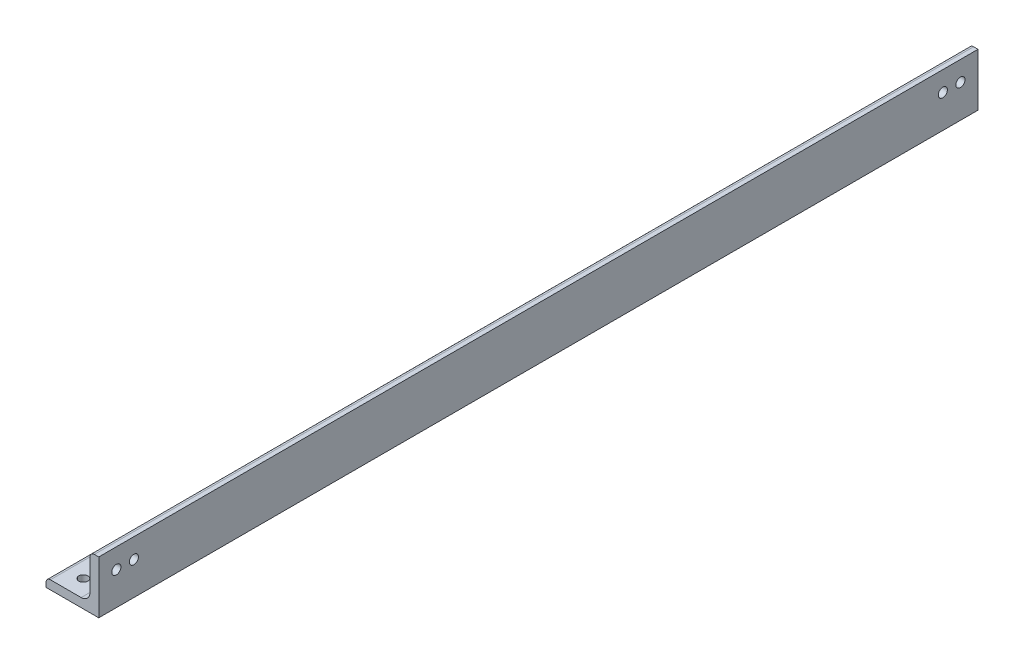
ISO-10303-21;
HEADER;
FILE_DESCRIPTION(('STEP AP214'),'2;1');
FILE_NAME('part.step','',(''),(''),'','','');
FILE_SCHEMA(('AUTOMOTIVE_DESIGN { 1 0 10303 214 1 1 1 1 }'));
ENDSEC;
DATA;
#1=APPLICATION_CONTEXT('core data for automotive mechanical design processes');
#2=APPLICATION_PROTOCOL_DEFINITION('international standard','automotive_design',2000,#1);
#3=PRODUCT_CONTEXT('',#1,'mechanical');
#4=PRODUCT('Part','Part','',(#3));
#5=PRODUCT_RELATED_PRODUCT_CATEGORY('part','',(#4));
#6=PRODUCT_DEFINITION_FORMATION('','',#4);
#7=PRODUCT_DEFINITION_CONTEXT('part definition',#1,'design');
#8=PRODUCT_DEFINITION('design','',#6,#7);
#9=PRODUCT_DEFINITION_SHAPE('','',#8);
#10=(LENGTH_UNIT() NAMED_UNIT(*) SI_UNIT(.MILLI.,.METRE.));
#11=(NAMED_UNIT(*) PLANE_ANGLE_UNIT() SI_UNIT($,.RADIAN.));
#12=(NAMED_UNIT(*) SI_UNIT($,.STERADIAN.) SOLID_ANGLE_UNIT());
#13=UNCERTAINTY_MEASURE_WITH_UNIT(LENGTH_MEASURE(1.E-05),#10,'distance_accuracy_value','');
#14=(GEOMETRIC_REPRESENTATION_CONTEXT(3) GLOBAL_UNCERTAINTY_ASSIGNED_CONTEXT((#13)) GLOBAL_UNIT_ASSIGNED_CONTEXT((#10,
#11,#12)) REPRESENTATION_CONTEXT('',''));
#15=CARTESIAN_POINT('',(0.,0.,0.));
#16=DIRECTION('',(0.,0.,1.));
#17=DIRECTION('',(1.,0.,0.));
#18=AXIS2_PLACEMENT_3D('',#15,#16,#17);
#19=CARTESIAN_POINT('',(-9.525,-7.9375,158.75));
#20=DIRECTION('',(1.,0.,0.));
#21=DIRECTION('',(0.,0.,-1.));
#22=AXIS2_PLACEMENT_3D('',#19,#20,#21);
#23=PLANE('',#22);
#24=DIRECTION('',(0.,-1.,0.));
#25=VECTOR('',#24,1.);
#26=CARTESIAN_POINT('',(-9.525,-7.9375,-158.75));
#27=LINE('',#26,#25);
#28=CARTESIAN_POINT('',(-9.525,-7.9375,-158.75));
#29=VERTEX_POINT('',#28);
#30=CARTESIAN_POINT('',(-9.525,-9.525,-158.75));
#31=VERTEX_POINT('',#30);
#32=EDGE_CURVE('E148',#29,#31,#27,.T.);
#33=ORIENTED_EDGE('',*,*,#32,.T.);
#34=DIRECTION('',(0.,0.,-1.));
#35=VECTOR('',#34,1.);
#36=CARTESIAN_POINT('',(-9.525,-9.525,158.75));
#37=LINE('',#36,#35);
#38=CARTESIAN_POINT('',(-9.525,-9.525,158.75));
#39=VERTEX_POINT('',#38);
#40=EDGE_CURVE('E11',#39,#31,#37,.T.);
#41=ORIENTED_EDGE('',*,*,#40,.F.);
#42=DIRECTION('',(0.,-1.,0.));
#43=VECTOR('',#42,1.);
#44=CARTESIAN_POINT('',(-9.525,-7.9375,158.75));
#45=LINE('',#44,#43);
#46=CARTESIAN_POINT('',(-9.525,-7.9375,158.75));
#47=VERTEX_POINT('',#46);
#48=EDGE_CURVE('E174',#47,#39,#45,.T.);
#49=ORIENTED_EDGE('',*,*,#48,.F.);
#50=DIRECTION('',(0.,0.,-1.));
#51=VECTOR('',#50,1.);
#52=CARTESIAN_POINT('',(-9.525,-7.9375,158.75));
#53=LINE('',#52,#51);
#54=EDGE_CURVE('E144',#47,#29,#53,.T.);
#55=ORIENTED_EDGE('',*,*,#54,.T.);
#56=EDGE_LOOP('',(#33,#41,#49,#55));
#57=FACE_BOUND('',#56,.T.);
#58=ADVANCED_FACE('F41',(#57),#23,.F.);
#59=CARTESIAN_POINT('',(-9.525,-9.525,158.75));
#60=DIRECTION('',(0.,1.,0.));
#61=DIRECTION('',(-1.,0.,0.));
#62=AXIS2_PLACEMENT_3D('',#59,#60,#61);
#63=PLANE('',#62);
#64=CARTESIAN_POINT('',(-2.38124999999999,-9.525,-152.4));
#65=DIRECTION('',(0.,1.,0.));
#66=DIRECTION('',(-1.,0.,0.));
#67=AXIS2_PLACEMENT_3D('',#64,#65,#66);
#68=CIRCLE('',#67,1.651);
#69=CARTESIAN_POINT('',(-4.03224999999999,-9.525,-152.4));
#70=VERTEX_POINT('',#69);
#71=EDGE_CURVE('E153',#70,#70,#68,.T.);
#72=ORIENTED_EDGE('',*,*,#71,.T.);
#73=EDGE_LOOP('',(#72));
#74=FACE_BOUND('',#73,.T.);
#75=CARTESIAN_POINT('',(-2.38124999999999,-9.525,-146.05));
#76=DIRECTION('',(0.,1.,0.));
#77=DIRECTION('',(-1.,0.,0.));
#78=AXIS2_PLACEMENT_3D('',#75,#76,#77);
#79=CIRCLE('',#78,1.651);
#80=CARTESIAN_POINT('',(-4.03224999999999,-9.525,-146.05));
#81=VERTEX_POINT('',#80);
#82=EDGE_CURVE('E249',#81,#81,#79,.T.);
#83=ORIENTED_EDGE('',*,*,#82,.T.);
#84=EDGE_LOOP('',(#83));
#85=FACE_BOUND('',#84,.T.);
#86=CARTESIAN_POINT('',(-2.38124999999996,-9.525,146.05));
#87=DIRECTION('',(0.,1.,0.));
#88=DIRECTION('',(1.,0.,0.));
#89=AXIS2_PLACEMENT_3D('',#86,#87,#88);
#90=CIRCLE('',#89,1.651);
#91=CARTESIAN_POINT('',(-0.730249999999962,-9.525,146.05));
#92=VERTEX_POINT('',#91);
#93=EDGE_CURVE('E241',#92,#92,#90,.T.);
#94=ORIENTED_EDGE('',*,*,#93,.T.);
#95=EDGE_LOOP('',(#94));
#96=FACE_BOUND('',#95,.T.);
#97=CARTESIAN_POINT('',(-2.38124999999996,-9.525,152.4));
#98=DIRECTION('',(0.,1.,0.));
#99=DIRECTION('',(1.,0.,0.));
#100=AXIS2_PLACEMENT_3D('',#97,#98,#99);
#101=CIRCLE('',#100,1.651);
#102=CARTESIAN_POINT('',(-0.73024999999996,-9.525,152.4));
#103=VERTEX_POINT('',#102);
#104=EDGE_CURVE('E232',#103,#103,#101,.T.);
#105=ORIENTED_EDGE('',*,*,#104,.T.);
#106=EDGE_LOOP('',(#105));
#107=FACE_BOUND('',#106,.T.);
#108=DIRECTION('',(1.,0.,0.));
#109=VECTOR('',#108,1.);
#110=CARTESIAN_POINT('',(-9.525,-9.525,-158.75));
#111=LINE('',#110,#109);
#112=CARTESIAN_POINT('',(9.525,-9.525,-158.75));
#113=VERTEX_POINT('',#112);
#114=EDGE_CURVE('E152',#31,#113,#111,.T.);
#115=ORIENTED_EDGE('',*,*,#114,.T.);
#116=DIRECTION('',(0.,0.,-1.));
#117=VECTOR('',#116,1.);
#118=CARTESIAN_POINT('',(9.525,-9.525,158.75));
#119=LINE('',#118,#117);
#120=CARTESIAN_POINT('',(9.525,-9.525,158.75));
#121=VERTEX_POINT('',#120);
#122=EDGE_CURVE('E50',#121,#113,#119,.T.);
#123=ORIENTED_EDGE('',*,*,#122,.F.);
#124=DIRECTION('',(1.,0.,0.));
#125=VECTOR('',#124,1.);
#126=CARTESIAN_POINT('',(-9.525,-9.525,158.75));
#127=LINE('',#126,#125);
#128=EDGE_CURVE('E104',#39,#121,#127,.T.);
#129=ORIENTED_EDGE('',*,*,#128,.F.);
#130=ORIENTED_EDGE('',*,*,#40,.T.);
#131=EDGE_LOOP('',(#115,#123,#129,#130));
#132=FACE_BOUND('',#131,.T.);
#133=ADVANCED_FACE('F326',(#74,#85,#96,#107,#132),#63,.F.);
#134=CARTESIAN_POINT('',(9.525,-9.525,158.75));
#135=DIRECTION('',(-1.,0.,0.));
#136=DIRECTION('',(0.,-1.,0.));
#137=AXIS2_PLACEMENT_3D('',#134,#135,#136);
#138=PLANE('',#137);
#139=CARTESIAN_POINT('',(9.525,2.38125000000003,-152.4));
#140=DIRECTION('',(-1.,0.,0.));
#141=DIRECTION('',(0.,-1.,0.));
#142=AXIS2_PLACEMENT_3D('',#139,#140,#141);
#143=CIRCLE('',#142,1.65099999999999);
#144=CARTESIAN_POINT('',(9.525,0.730250000000035,-152.4));
#145=VERTEX_POINT('',#144);
#146=EDGE_CURVE('E233',#145,#145,#143,.T.);
#147=ORIENTED_EDGE('',*,*,#146,.T.);
#148=EDGE_LOOP('',(#147));
#149=FACE_BOUND('',#148,.T.);
#150=CARTESIAN_POINT('',(9.525,2.38125000000005,-146.05));
#151=DIRECTION('',(-1.,0.,0.));
#152=DIRECTION('',(0.,-1.,0.));
#153=AXIS2_PLACEMENT_3D('',#150,#151,#152);
#154=CIRCLE('',#153,1.65099999999999);
#155=CARTESIAN_POINT('',(9.525,0.730250000000059,-146.05));
#156=VERTEX_POINT('',#155);
#157=EDGE_CURVE('E280',#156,#156,#154,.T.);
#158=ORIENTED_EDGE('',*,*,#157,.T.);
#159=EDGE_LOOP('',(#158));
#160=FACE_BOUND('',#159,.T.);
#161=CARTESIAN_POINT('',(9.525,2.38125000000009,146.05));
#162=DIRECTION('',(-1.,0.,0.));
#163=DIRECTION('',(0.,1.,0.));
#164=AXIS2_PLACEMENT_3D('',#161,#162,#163);
#165=CIRCLE('',#164,1.65100000000002);
#166=CARTESIAN_POINT('',(9.525,4.03225000000011,146.05));
#167=VERTEX_POINT('',#166);
#168=EDGE_CURVE('E272',#167,#167,#165,.T.);
#169=ORIENTED_EDGE('',*,*,#168,.T.);
#170=EDGE_LOOP('',(#169));
#171=FACE_BOUND('',#170,.T.);
#172=CARTESIAN_POINT('',(9.525,2.38125000000006,152.4));
#173=DIRECTION('',(-1.,0.,0.));
#174=DIRECTION('',(0.,1.,0.));
#175=AXIS2_PLACEMENT_3D('',#172,#173,#174);
#176=CIRCLE('',#175,1.65100000000002);
#177=CARTESIAN_POINT('',(9.525,4.03225000000008,152.4));
#178=VERTEX_POINT('',#177);
#179=EDGE_CURVE('E264',#178,#178,#176,.T.);
#180=ORIENTED_EDGE('',*,*,#179,.T.);
#181=EDGE_LOOP('',(#180));
#182=FACE_BOUND('',#181,.T.);
#183=DIRECTION('',(0.,1.,0.));
#184=VECTOR('',#183,1.);
#185=CARTESIAN_POINT('',(9.525,-9.525,-158.75));
#186=LINE('',#185,#184);
#187=CARTESIAN_POINT('',(9.525,9.525,-158.75));
#188=VERTEX_POINT('',#187);
#189=EDGE_CURVE('E156',#113,#188,#186,.T.);
#190=ORIENTED_EDGE('',*,*,#189,.T.);
#191=DIRECTION('',(0.,0.,-1.));
#192=VECTOR('',#191,1.);
#193=CARTESIAN_POINT('',(9.525,9.525,158.75));
#194=LINE('',#193,#192);
#195=CARTESIAN_POINT('',(9.525,9.525,158.75));
#196=VERTEX_POINT('',#195);
#197=EDGE_CURVE('E189',#196,#188,#194,.T.);
#198=ORIENTED_EDGE('',*,*,#197,.F.);
#199=DIRECTION('',(0.,1.,0.));
#200=VECTOR('',#199,1.);
#201=CARTESIAN_POINT('',(9.525,-9.525,158.75));
#202=LINE('',#201,#200);
#203=EDGE_CURVE('E199',#121,#196,#202,.T.);
#204=ORIENTED_EDGE('',*,*,#203,.F.);
#205=ORIENTED_EDGE('',*,*,#122,.T.);
#206=EDGE_LOOP('',(#190,#198,#204,#205));
#207=FACE_BOUND('',#206,.T.);
#208=ADVANCED_FACE('F197',(#149,#160,#171,#182,#207),#138,.F.);
#209=CARTESIAN_POINT('',(7.9375,9.525,158.75));
#210=DIRECTION('',(0.,-1.,0.));
#211=DIRECTION('',(1.,0.,0.));
#212=AXIS2_PLACEMENT_3D('',#209,#210,#211);
#213=PLANE('',#212);
#214=DIRECTION('',(-1.,0.,0.));
#215=VECTOR('',#214,1.);
#216=CARTESIAN_POINT('',(7.9375,9.525,-158.75));
#217=LINE('',#216,#215);
#218=CARTESIAN_POINT('',(7.9375,9.525,-158.75));
#219=VERTEX_POINT('',#218);
#220=EDGE_CURVE('E159',#188,#219,#217,.T.);
#221=ORIENTED_EDGE('',*,*,#220,.T.);
#222=DIRECTION('',(0.,0.,-1.));
#223=VECTOR('',#222,1.);
#224=CARTESIAN_POINT('',(7.9375,9.525,158.75));
#225=LINE('',#224,#223);
#226=CARTESIAN_POINT('',(7.9375,9.525,158.75));
#227=VERTEX_POINT('',#226);
#228=EDGE_CURVE('E185',#227,#219,#225,.T.);
#229=ORIENTED_EDGE('',*,*,#228,.F.);
#230=DIRECTION('',(-1.,0.,0.));
#231=VECTOR('',#230,1.);
#232=CARTESIAN_POINT('',(7.9375,9.525,158.75));
#233=LINE('',#232,#231);
#234=EDGE_CURVE('E216',#196,#227,#233,.T.);
#235=ORIENTED_EDGE('',*,*,#234,.F.);
#236=ORIENTED_EDGE('',*,*,#197,.T.);
#237=EDGE_LOOP('',(#221,#229,#235,#236));
#238=FACE_BOUND('',#237,.T.);
#239=ADVANCED_FACE('F208',(#238),#213,.F.);
#240=CARTESIAN_POINT('',(7.9375,7.9375,158.75));
#241=DIRECTION('',(0.,0.,-1.));
#242=DIRECTION('',(-1.,0.,0.));
#243=AXIS2_PLACEMENT_3D('',#240,#241,#242);
#244=CYLINDRICAL_SURFACE('',#243,1.5875);
#245=CARTESIAN_POINT('',(7.9375,7.9375,-158.75));
#246=DIRECTION('',(0.,0.,1.));
#247=DIRECTION('',(-1.,0.,0.));
#248=AXIS2_PLACEMENT_3D('',#245,#246,#247);
#249=CIRCLE('',#248,1.5875);
#250=CARTESIAN_POINT('',(6.35,7.9375,-158.75));
#251=VERTEX_POINT('',#250);
#252=EDGE_CURVE('E162',#219,#251,#249,.T.);
#253=ORIENTED_EDGE('',*,*,#252,.T.);
#254=DIRECTION('',(0.,0.,-1.));
#255=VECTOR('',#254,1.);
#256=CARTESIAN_POINT('',(6.35,7.9375,158.75));
#257=LINE('',#256,#255);
#258=CARTESIAN_POINT('',(6.35,7.9375,158.75));
#259=VERTEX_POINT('',#258);
#260=EDGE_CURVE('E181',#259,#251,#257,.T.);
#261=ORIENTED_EDGE('',*,*,#260,.F.);
#262=CARTESIAN_POINT('',(7.9375,7.9375,158.75));
#263=DIRECTION('',(0.,0.,1.));
#264=DIRECTION('',(-1.,0.,0.));
#265=AXIS2_PLACEMENT_3D('',#262,#263,#264);
#266=CIRCLE('',#265,1.5875);
#267=EDGE_CURVE('E214',#227,#259,#266,.T.);
#268=ORIENTED_EDGE('',*,*,#267,.F.);
#269=ORIENTED_EDGE('',*,*,#228,.T.);
#270=EDGE_LOOP('',(#253,#261,#268,#269));
#271=FACE_BOUND('',#270,.T.);
#272=ADVANCED_FACE('F212',(#271),#244,.T.);
#273=CARTESIAN_POINT('',(6.35,7.9375,158.75));
#274=DIRECTION('',(1.,0.,0.));
#275=DIRECTION('',(0.,1.,0.));
#276=AXIS2_PLACEMENT_3D('',#273,#274,#275);
#277=PLANE('',#276);
#278=CARTESIAN_POINT('',(6.35,2.38125000000003,-152.4));
#279=DIRECTION('',(-1.,0.,0.));
#280=DIRECTION('',(0.,-1.,0.));
#281=AXIS2_PLACEMENT_3D('',#278,#279,#280);
#282=CIRCLE('',#281,1.65099999999999);
#283=CARTESIAN_POINT('',(6.35,0.730250000000034,-152.4));
#284=VERTEX_POINT('',#283);
#285=EDGE_CURVE('E284',#284,#284,#282,.T.);
#286=ORIENTED_EDGE('',*,*,#285,.F.);
#287=EDGE_LOOP('',(#286));
#288=FACE_BOUND('',#287,.T.);
#289=CARTESIAN_POINT('',(6.35,2.38125000000005,-146.05));
#290=DIRECTION('',(-1.,0.,0.));
#291=DIRECTION('',(0.,-1.,0.));
#292=AXIS2_PLACEMENT_3D('',#289,#290,#291);
#293=CIRCLE('',#292,1.65099999999999);
#294=CARTESIAN_POINT('',(6.35,0.730250000000059,-146.05));
#295=VERTEX_POINT('',#294);
#296=EDGE_CURVE('E276',#295,#295,#293,.T.);
#297=ORIENTED_EDGE('',*,*,#296,.F.);
#298=EDGE_LOOP('',(#297));
#299=FACE_BOUND('',#298,.T.);
#300=CARTESIAN_POINT('',(6.35,2.38125000000009,146.05));
#301=DIRECTION('',(-1.,0.,0.));
#302=DIRECTION('',(0.,1.,0.));
#303=AXIS2_PLACEMENT_3D('',#300,#301,#302);
#304=CIRCLE('',#303,1.65100000000002);
#305=CARTESIAN_POINT('',(6.35,4.03225000000011,146.05));
#306=VERTEX_POINT('',#305);
#307=EDGE_CURVE('E268',#306,#306,#304,.T.);
#308=ORIENTED_EDGE('',*,*,#307,.F.);
#309=EDGE_LOOP('',(#308));
#310=FACE_BOUND('',#309,.T.);
#311=CARTESIAN_POINT('',(6.35,2.38125000000006,152.4));
#312=DIRECTION('',(-1.,0.,0.));
#313=DIRECTION('',(0.,1.,0.));
#314=AXIS2_PLACEMENT_3D('',#311,#312,#313);
#315=CIRCLE('',#314,1.65100000000002);
#316=CARTESIAN_POINT('',(6.35,4.03225000000008,152.4));
#317=VERTEX_POINT('',#316);
#318=EDGE_CURVE('E260',#317,#317,#315,.T.);
#319=ORIENTED_EDGE('',*,*,#318,.F.);
#320=EDGE_LOOP('',(#319));
#321=FACE_BOUND('',#320,.T.);
#322=DIRECTION('',(0.,-1.,0.));
#323=VECTOR('',#322,1.);
#324=CARTESIAN_POINT('',(6.35,7.9375,-158.75));
#325=LINE('',#324,#323);
#326=CARTESIAN_POINT('',(6.35,-3.175,-158.75));
#327=VERTEX_POINT('',#326);
#328=EDGE_CURVE('E165',#251,#327,#325,.T.);
#329=ORIENTED_EDGE('',*,*,#328,.T.);
#330=DIRECTION('',(0.,0.,-1.));
#331=VECTOR('',#330,1.);
#332=CARTESIAN_POINT('',(6.35,-3.175,158.75));
#333=LINE('',#332,#331);
#334=CARTESIAN_POINT('',(6.35,-3.175,158.75));
#335=VERTEX_POINT('',#334);
#336=EDGE_CURVE('E137',#335,#327,#333,.T.);
#337=ORIENTED_EDGE('',*,*,#336,.F.);
#338=DIRECTION('',(0.,-1.,0.));
#339=VECTOR('',#338,1.);
#340=CARTESIAN_POINT('',(6.35,7.9375,158.75));
#341=LINE('',#340,#339);
#342=EDGE_CURVE('E126',#259,#335,#341,.T.);
#343=ORIENTED_EDGE('',*,*,#342,.F.);
#344=ORIENTED_EDGE('',*,*,#260,.T.);
#345=EDGE_LOOP('',(#329,#337,#343,#344));
#346=FACE_BOUND('',#345,.T.);
#347=ADVANCED_FACE('F301',(#288,#299,#310,#321,#346),#277,.F.);
#348=CARTESIAN_POINT('',(3.17500000000001,-3.175,158.75));
#349=DIRECTION('',(0.,0.,-1.));
#350=DIRECTION('',(-1.,0.,0.));
#351=AXIS2_PLACEMENT_3D('',#348,#349,#350);
#352=CYLINDRICAL_SURFACE('',#351,3.175);
#353=CARTESIAN_POINT('',(3.17500000000001,-3.175,-158.75));
#354=DIRECTION('',(0.,0.,-1.));
#355=DIRECTION('',(-1.,0.,0.));
#356=AXIS2_PLACEMENT_3D('',#353,#354,#355);
#357=CIRCLE('',#356,3.175);
#358=CARTESIAN_POINT('',(3.17500000000001,-6.35,-158.75));
#359=VERTEX_POINT('',#358);
#360=EDGE_CURVE('E135',#327,#359,#357,.T.);
#361=ORIENTED_EDGE('',*,*,#360,.T.);
#362=DIRECTION('',(0.,0.,-1.));
#363=VECTOR('',#362,1.);
#364=CARTESIAN_POINT('',(3.17500000000001,-6.35,158.75));
#365=LINE('',#364,#363);
#366=CARTESIAN_POINT('',(3.17500000000001,-6.35,158.75));
#367=VERTEX_POINT('',#366);
#368=EDGE_CURVE('E132',#367,#359,#365,.T.);
#369=ORIENTED_EDGE('',*,*,#368,.F.);
#370=CARTESIAN_POINT('',(3.17500000000001,-3.175,158.75));
#371=DIRECTION('',(0.,0.,-1.));
#372=DIRECTION('',(-1.,0.,0.));
#373=AXIS2_PLACEMENT_3D('',#370,#371,#372);
#374=CIRCLE('',#373,3.175);
#375=EDGE_CURVE('E120',#335,#367,#374,.T.);
#376=ORIENTED_EDGE('',*,*,#375,.F.);
#377=ORIENTED_EDGE('',*,*,#336,.T.);
#378=EDGE_LOOP('',(#361,#369,#376,#377));
#379=FACE_BOUND('',#378,.T.);
#380=ADVANCED_FACE('F133',(#379),#352,.F.);
#381=CARTESIAN_POINT('',(3.17500000000001,-6.35,158.75));
#382=DIRECTION('',(0.,-1.,0.));
#383=DIRECTION('',(1.,0.,0.));
#384=AXIS2_PLACEMENT_3D('',#381,#382,#383);
#385=PLANE('',#384);
#386=CARTESIAN_POINT('',(-2.38125,-6.35,-152.4));
#387=DIRECTION('',(0.,1.,0.));
#388=DIRECTION('',(-1.,0.,0.));
#389=AXIS2_PLACEMENT_3D('',#386,#387,#388);
#390=CIRCLE('',#389,1.651);
#391=CARTESIAN_POINT('',(-4.03224999999999,-6.35,-152.4));
#392=VERTEX_POINT('',#391);
#393=EDGE_CURVE('E253',#392,#392,#390,.T.);
#394=ORIENTED_EDGE('',*,*,#393,.F.);
#395=EDGE_LOOP('',(#394));
#396=FACE_BOUND('',#395,.T.);
#397=CARTESIAN_POINT('',(-2.38125,-6.35,-146.05));
#398=DIRECTION('',(0.,1.,0.));
#399=DIRECTION('',(-1.,0.,0.));
#400=AXIS2_PLACEMENT_3D('',#397,#398,#399);
#401=CIRCLE('',#400,1.651);
#402=CARTESIAN_POINT('',(-4.03224999999999,-6.35,-146.05));
#403=VERTEX_POINT('',#402);
#404=EDGE_CURVE('E245',#403,#403,#401,.T.);
#405=ORIENTED_EDGE('',*,*,#404,.F.);
#406=EDGE_LOOP('',(#405));
#407=FACE_BOUND('',#406,.T.);
#408=CARTESIAN_POINT('',(-2.38124999999996,-6.35,146.05));
#409=DIRECTION('',(0.,1.,0.));
#410=DIRECTION('',(1.,0.,0.));
#411=AXIS2_PLACEMENT_3D('',#408,#409,#410);
#412=CIRCLE('',#411,1.651);
#413=CARTESIAN_POINT('',(-0.730249999999963,-6.35,146.05));
#414=VERTEX_POINT('',#413);
#415=EDGE_CURVE('E237',#414,#414,#412,.T.);
#416=ORIENTED_EDGE('',*,*,#415,.F.);
#417=EDGE_LOOP('',(#416));
#418=FACE_BOUND('',#417,.T.);
#419=CARTESIAN_POINT('',(-2.38124999999996,-6.35,152.4));
#420=DIRECTION('',(0.,1.,0.));
#421=DIRECTION('',(1.,0.,0.));
#422=AXIS2_PLACEMENT_3D('',#419,#420,#421);
#423=CIRCLE('',#422,1.651);
#424=CARTESIAN_POINT('',(-0.730249999999961,-6.35,152.4));
#425=VERTEX_POINT('',#424);
#426=EDGE_CURVE('E228',#425,#425,#423,.T.);
#427=ORIENTED_EDGE('',*,*,#426,.F.);
#428=EDGE_LOOP('',(#427));
#429=FACE_BOUND('',#428,.T.);
#430=DIRECTION('',(-1.,0.,0.));
#431=VECTOR('',#430,1.);
#432=CARTESIAN_POINT('',(3.17500000000001,-6.35,-158.75));
#433=LINE('',#432,#431);
#434=CARTESIAN_POINT('',(-7.9375,-6.35,-158.75));
#435=VERTEX_POINT('',#434);
#436=EDGE_CURVE('E90',#359,#435,#433,.T.);
#437=ORIENTED_EDGE('',*,*,#436,.T.);
#438=DIRECTION('',(0.,0.,-1.));
#439=VECTOR('',#438,1.);
#440=CARTESIAN_POINT('',(-7.9375,-6.35,158.75));
#441=LINE('',#440,#439);
#442=CARTESIAN_POINT('',(-7.9375,-6.35,158.75));
#443=VERTEX_POINT('',#442);
#444=EDGE_CURVE('E138',#443,#435,#441,.T.);
#445=ORIENTED_EDGE('',*,*,#444,.F.);
#446=DIRECTION('',(-1.,0.,0.));
#447=VECTOR('',#446,1.);
#448=CARTESIAN_POINT('',(3.17500000000001,-6.35,158.75));
#449=LINE('',#448,#447);
#450=EDGE_CURVE('E124',#367,#443,#449,.T.);
#451=ORIENTED_EDGE('',*,*,#450,.F.);
#452=ORIENTED_EDGE('',*,*,#368,.T.);
#453=EDGE_LOOP('',(#437,#445,#451,#452));
#454=FACE_BOUND('',#453,.T.);
#455=ADVANCED_FACE('F140',(#396,#407,#418,#429,#454),#385,.F.);
#456=CARTESIAN_POINT('',(-7.9375,-7.9375,158.75));
#457=DIRECTION('',(0.,0.,-1.));
#458=DIRECTION('',(-1.,0.,0.));
#459=AXIS2_PLACEMENT_3D('',#456,#457,#458);
#460=CYLINDRICAL_SURFACE('',#459,1.5875);
#461=CARTESIAN_POINT('',(-7.9375,-7.9375,-158.75));
#462=DIRECTION('',(0.,0.,1.));
#463=DIRECTION('',(-1.,0.,0.));
#464=AXIS2_PLACEMENT_3D('',#461,#462,#463);
#465=CIRCLE('',#464,1.5875);
#466=EDGE_CURVE('E96',#435,#29,#465,.T.);
#467=ORIENTED_EDGE('',*,*,#466,.T.);
#468=ORIENTED_EDGE('',*,*,#54,.F.);
#469=CARTESIAN_POINT('',(-7.9375,-7.9375,158.75));
#470=DIRECTION('',(0.,0.,1.));
#471=DIRECTION('',(-1.,0.,0.));
#472=AXIS2_PLACEMENT_3D('',#469,#470,#471);
#473=CIRCLE('',#472,1.5875);
#474=EDGE_CURVE('E58',#443,#47,#473,.T.);
#475=ORIENTED_EDGE('',*,*,#474,.F.);
#476=ORIENTED_EDGE('',*,*,#444,.T.);
#477=EDGE_LOOP('',(#467,#468,#475,#476));
#478=FACE_BOUND('',#477,.T.);
#479=ADVANCED_FACE('F314',(#478),#460,.T.);
#480=CARTESIAN_POINT('',(7.9375,7.9375,158.75));
#481=DIRECTION('',(0.,0.,-1.));
#482=DIRECTION('',(-1.,0.,0.));
#483=AXIS2_PLACEMENT_3D('',#480,#481,#482);
#484=PLANE('',#483);
#485=ORIENTED_EDGE('',*,*,#48,.T.);
#486=ORIENTED_EDGE('',*,*,#128,.T.);
#487=ORIENTED_EDGE('',*,*,#203,.T.);
#488=ORIENTED_EDGE('',*,*,#234,.T.);
#489=ORIENTED_EDGE('',*,*,#267,.T.);
#490=ORIENTED_EDGE('',*,*,#342,.T.);
#491=ORIENTED_EDGE('',*,*,#375,.T.);
#492=ORIENTED_EDGE('',*,*,#450,.T.);
#493=ORIENTED_EDGE('',*,*,#474,.T.);
#494=EDGE_LOOP('',(#485,#486,#487,#488,#489,#490,#491,#492,#493));
#495=FACE_BOUND('',#494,.T.);
#496=ADVANCED_FACE('F122',(#495),#484,.F.);
#497=CARTESIAN_POINT('',(7.9375,7.9375,-158.75));
#498=DIRECTION('',(0.,0.,-1.));
#499=DIRECTION('',(-1.,0.,0.));
#500=AXIS2_PLACEMENT_3D('',#497,#498,#499);
#501=PLANE('',#500);
#502=ORIENTED_EDGE('',*,*,#32,.F.);
#503=ORIENTED_EDGE('',*,*,#466,.F.);
#504=ORIENTED_EDGE('',*,*,#436,.F.);
#505=ORIENTED_EDGE('',*,*,#360,.F.);
#506=ORIENTED_EDGE('',*,*,#328,.F.);
#507=ORIENTED_EDGE('',*,*,#252,.F.);
#508=ORIENTED_EDGE('',*,*,#220,.F.);
#509=ORIENTED_EDGE('',*,*,#189,.F.);
#510=ORIENTED_EDGE('',*,*,#114,.F.);
#511=EDGE_LOOP('',(#502,#503,#504,#505,#506,#507,#508,#509,#510));
#512=FACE_BOUND('',#511,.T.);
#513=ADVANCED_FACE('F203',(#512),#501,.T.);
#514=CARTESIAN_POINT('',(-2.38124999999996,-9.525,152.4));
#515=DIRECTION('',(0.,1.,0.));
#516=DIRECTION('',(-1.,0.,0.));
#517=AXIS2_PLACEMENT_3D('',#514,#515,#516);
#518=CYLINDRICAL_SURFACE('',#517,1.651);
#519=ORIENTED_EDGE('',*,*,#104,.F.);
#520=EDGE_LOOP('',(#519));
#521=FACE_BOUND('',#520,.T.);
#522=ORIENTED_EDGE('',*,*,#426,.T.);
#523=EDGE_LOOP('',(#522));
#524=FACE_BOUND('',#523,.T.);
#525=ADVANCED_FACE('F360',(#521,#524),#518,.F.);
#526=CARTESIAN_POINT('',(-2.38124999999996,-9.525,146.05));
#527=DIRECTION('',(0.,1.,0.));
#528=DIRECTION('',(-1.,0.,0.));
#529=AXIS2_PLACEMENT_3D('',#526,#527,#528);
#530=CYLINDRICAL_SURFACE('',#529,1.651);
#531=ORIENTED_EDGE('',*,*,#93,.F.);
#532=EDGE_LOOP('',(#531));
#533=FACE_BOUND('',#532,.T.);
#534=ORIENTED_EDGE('',*,*,#415,.T.);
#535=EDGE_LOOP('',(#534));
#536=FACE_BOUND('',#535,.T.);
#537=ADVANCED_FACE('F365',(#533,#536),#530,.F.);
#538=CARTESIAN_POINT('',(-2.38124999999999,-9.525,-146.05));
#539=DIRECTION('',(0.,1.,0.));
#540=DIRECTION('',(-1.,0.,0.));
#541=AXIS2_PLACEMENT_3D('',#538,#539,#540);
#542=CYLINDRICAL_SURFACE('',#541,1.651);
#543=ORIENTED_EDGE('',*,*,#82,.F.);
#544=EDGE_LOOP('',(#543));
#545=FACE_BOUND('',#544,.T.);
#546=ORIENTED_EDGE('',*,*,#404,.T.);
#547=EDGE_LOOP('',(#546));
#548=FACE_BOUND('',#547,.T.);
#549=ADVANCED_FACE('F377',(#545,#548),#542,.F.);
#550=CARTESIAN_POINT('',(-2.38124999999999,-9.525,-152.4));
#551=DIRECTION('',(0.,1.,0.));
#552=DIRECTION('',(-1.,0.,0.));
#553=AXIS2_PLACEMENT_3D('',#550,#551,#552);
#554=CYLINDRICAL_SURFACE('',#553,1.651);
#555=ORIENTED_EDGE('',*,*,#71,.F.);
#556=EDGE_LOOP('',(#555));
#557=FACE_BOUND('',#556,.T.);
#558=ORIENTED_EDGE('',*,*,#393,.T.);
#559=EDGE_LOOP('',(#558));
#560=FACE_BOUND('',#559,.T.);
#561=ADVANCED_FACE('F387',(#557,#560),#554,.F.);
#562=CARTESIAN_POINT('',(9.525,2.38125000000006,152.4));
#563=DIRECTION('',(-1.,0.,0.));
#564=DIRECTION('',(0.,-1.,0.));
#565=AXIS2_PLACEMENT_3D('',#562,#563,#564);
#566=CYLINDRICAL_SURFACE('',#565,1.65100000000002);
#567=ORIENTED_EDGE('',*,*,#179,.F.);
#568=EDGE_LOOP('',(#567));
#569=FACE_BOUND('',#568,.T.);
#570=ORIENTED_EDGE('',*,*,#318,.T.);
#571=EDGE_LOOP('',(#570));
#572=FACE_BOUND('',#571,.T.);
#573=ADVANCED_FACE('F397',(#569,#572),#566,.F.);
#574=CARTESIAN_POINT('',(9.525,2.38125000000009,146.05));
#575=DIRECTION('',(-1.,0.,0.));
#576=DIRECTION('',(0.,-1.,0.));
#577=AXIS2_PLACEMENT_3D('',#574,#575,#576);
#578=CYLINDRICAL_SURFACE('',#577,1.65100000000002);
#579=ORIENTED_EDGE('',*,*,#168,.F.);
#580=EDGE_LOOP('',(#579));
#581=FACE_BOUND('',#580,.T.);
#582=ORIENTED_EDGE('',*,*,#307,.T.);
#583=EDGE_LOOP('',(#582));
#584=FACE_BOUND('',#583,.T.);
#585=ADVANCED_FACE('F419',(#581,#584),#578,.F.);
#586=CARTESIAN_POINT('',(9.525,2.38125000000005,-146.05));
#587=DIRECTION('',(-1.,0.,0.));
#588=DIRECTION('',(0.,-1.,0.));
#589=AXIS2_PLACEMENT_3D('',#586,#587,#588);
#590=CYLINDRICAL_SURFACE('',#589,1.65099999999999);
#591=ORIENTED_EDGE('',*,*,#157,.F.);
#592=EDGE_LOOP('',(#591));
#593=FACE_BOUND('',#592,.T.);
#594=ORIENTED_EDGE('',*,*,#296,.T.);
#595=EDGE_LOOP('',(#594));
#596=FACE_BOUND('',#595,.T.);
#597=ADVANCED_FACE('F297',(#593,#596),#590,.F.);
#598=CARTESIAN_POINT('',(9.525,2.38125000000003,-152.4));
#599=DIRECTION('',(-1.,0.,0.));
#600=DIRECTION('',(0.,-1.,0.));
#601=AXIS2_PLACEMENT_3D('',#598,#599,#600);
#602=CYLINDRICAL_SURFACE('',#601,1.65099999999999);
#603=ORIENTED_EDGE('',*,*,#146,.F.);
#604=EDGE_LOOP('',(#603));
#605=FACE_BOUND('',#604,.T.);
#606=ORIENTED_EDGE('',*,*,#285,.T.);
#607=EDGE_LOOP('',(#606));
#608=FACE_BOUND('',#607,.T.);
#609=ADVANCED_FACE('F294',(#605,#608),#602,.F.);
#610=CLOSED_SHELL('',(#58,#133,#208,#239,#272,#347,#380,#455,#479,#496,#513,#525,#537,#549,#561,
#573,#585,#597,#609));
#611=MANIFOLD_SOLID_BREP('B2',#610);
#612=ADVANCED_BREP_SHAPE_REPRESENTATION('',(#18,#611),#14);
#613=SHAPE_DEFINITION_REPRESENTATION(#9,#612);
ENDSEC;
END-ISO-10303-21;
